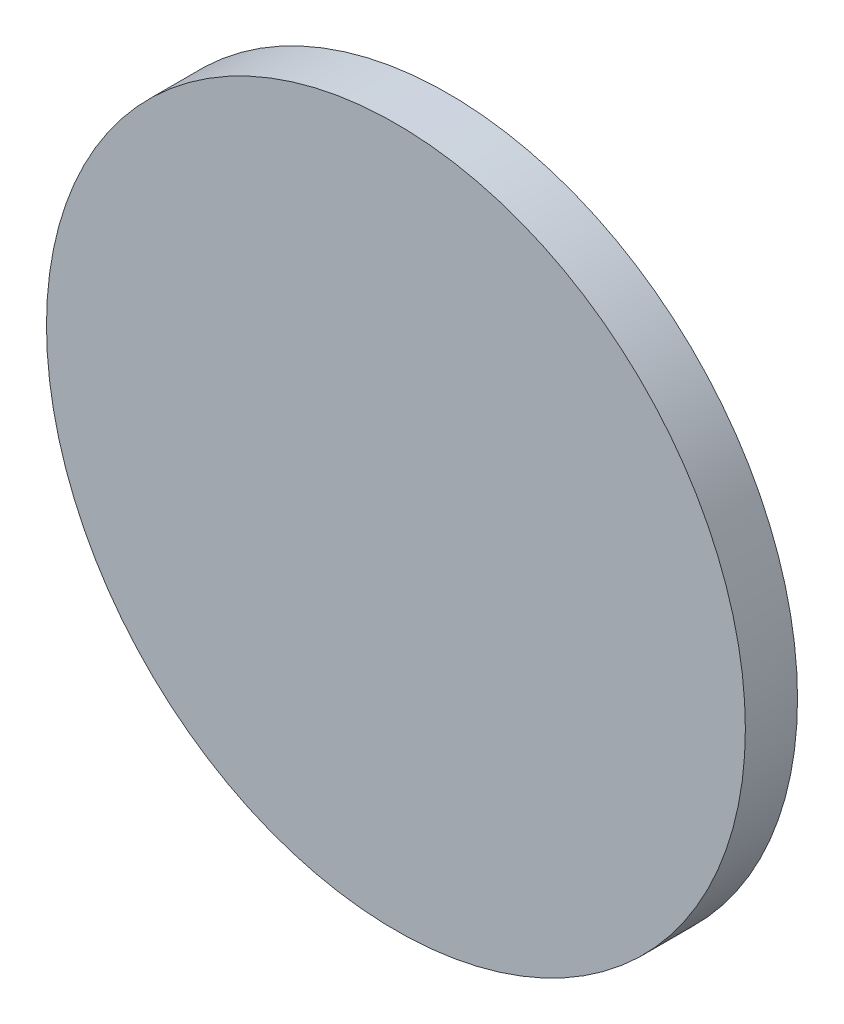
ISO-10303-21;
HEADER;
FILE_DESCRIPTION(('STEP AP214'),'2;1');
FILE_NAME('part.step','',(''),(''),'','','');
FILE_SCHEMA(('AUTOMOTIVE_DESIGN { 1 0 10303 214 1 1 1 1 }'));
ENDSEC;
DATA;
#1=APPLICATION_CONTEXT('core data for automotive mechanical design processes');
#2=APPLICATION_PROTOCOL_DEFINITION('international standard','automotive_design',2000,#1);
#3=PRODUCT_CONTEXT('',#1,'mechanical');
#4=PRODUCT('Part','Part','',(#3));
#5=PRODUCT_RELATED_PRODUCT_CATEGORY('part','',(#4));
#6=PRODUCT_DEFINITION_FORMATION('','',#4);
#7=PRODUCT_DEFINITION_CONTEXT('part definition',#1,'design');
#8=PRODUCT_DEFINITION('design','',#6,#7);
#9=PRODUCT_DEFINITION_SHAPE('','',#8);
#10=(LENGTH_UNIT() NAMED_UNIT(*) SI_UNIT(.MILLI.,.METRE.));
#11=(NAMED_UNIT(*) PLANE_ANGLE_UNIT() SI_UNIT($,.RADIAN.));
#12=(NAMED_UNIT(*) SI_UNIT($,.STERADIAN.) SOLID_ANGLE_UNIT());
#13=UNCERTAINTY_MEASURE_WITH_UNIT(LENGTH_MEASURE(1.E-05),#10,'distance_accuracy_value','');
#14=(GEOMETRIC_REPRESENTATION_CONTEXT(3) GLOBAL_UNCERTAINTY_ASSIGNED_CONTEXT((#13)) GLOBAL_UNIT_ASSIGNED_CONTEXT((#10,
#11,#12)) REPRESENTATION_CONTEXT('',''));
#15=CARTESIAN_POINT('',(0.,0.,0.));
#16=DIRECTION('',(0.,0.,1.));
#17=DIRECTION('',(1.,0.,0.));
#18=AXIS2_PLACEMENT_3D('',#15,#16,#17);
#19=CARTESIAN_POINT('',(0.,0.,1.));
#20=DIRECTION('',(0.,0.,-1.));
#21=DIRECTION('',(-1.,0.,0.));
#22=AXIS2_PLACEMENT_3D('',#19,#20,#21);
#23=CYLINDRICAL_SURFACE('',#22,6.7);
#24=CARTESIAN_POINT('',(0.,0.,1.));
#25=DIRECTION('',(0.,0.,1.));
#26=DIRECTION('',(1.,0.,0.));
#27=AXIS2_PLACEMENT_3D('',#24,#25,#26);
#28=CIRCLE('',#27,6.7);
#29=CARTESIAN_POINT('',(6.7,0.,1.));
#30=VERTEX_POINT('',#29);
#31=EDGE_CURVE('E10',#30,#30,#28,.T.);
#32=ORIENTED_EDGE('',*,*,#31,.F.);
#33=EDGE_LOOP('',(#32));
#34=FACE_BOUND('',#33,.T.);
#35=CARTESIAN_POINT('',(0.,0.,0.));
#36=DIRECTION('',(0.,0.,1.));
#37=DIRECTION('',(1.,0.,0.));
#38=AXIS2_PLACEMENT_3D('',#35,#36,#37);
#39=CIRCLE('',#38,6.7);
#40=CARTESIAN_POINT('',(6.7,0.,0.));
#41=VERTEX_POINT('',#40);
#42=EDGE_CURVE('E34',#41,#41,#39,.T.);
#43=ORIENTED_EDGE('',*,*,#42,.T.);
#44=EDGE_LOOP('',(#43));
#45=FACE_BOUND('',#44,.T.);
#46=ADVANCED_FACE('F31',(#34,#45),#23,.T.);
#47=CARTESIAN_POINT('',(0.,0.,1.));
#48=DIRECTION('',(0.,0.,1.));
#49=DIRECTION('',(1.,0.,0.));
#50=AXIS2_PLACEMENT_3D('',#47,#48,#49);
#51=PLANE('',#50);
#52=ORIENTED_EDGE('',*,*,#31,.T.);
#53=EDGE_LOOP('',(#52));
#54=FACE_BOUND('',#53,.T.);
#55=ADVANCED_FACE('F46',(#54),#51,.T.);
#56=CARTESIAN_POINT('',(0.,0.,0.));
#57=DIRECTION('',(0.,0.,1.));
#58=DIRECTION('',(1.,0.,0.));
#59=AXIS2_PLACEMENT_3D('',#56,#57,#58);
#60=PLANE('',#59);
#61=ORIENTED_EDGE('',*,*,#42,.F.);
#62=EDGE_LOOP('',(#61));
#63=FACE_BOUND('',#62,.T.);
#64=ADVANCED_FACE('F44',(#63),#60,.F.);
#65=CLOSED_SHELL('',(#46,#55,#64));
#66=MANIFOLD_SOLID_BREP('B2',#65);
#67=ADVANCED_BREP_SHAPE_REPRESENTATION('',(#18,#66),#14);
#68=SHAPE_DEFINITION_REPRESENTATION(#9,#67);
ENDSEC;
END-ISO-10303-21;
